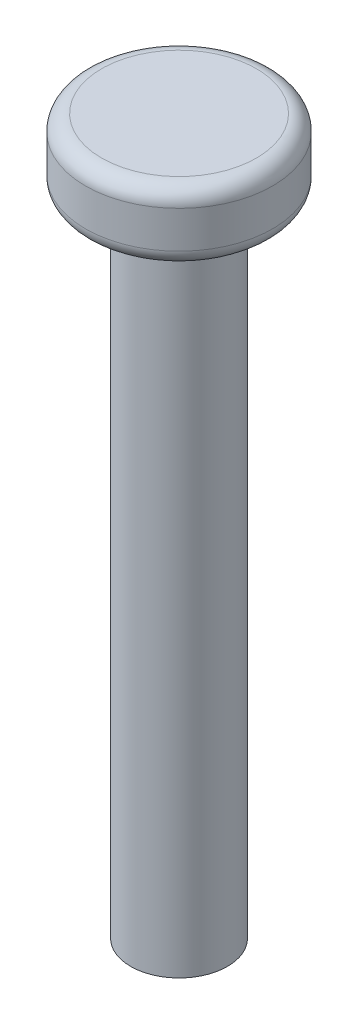
ISO-10303-21;
HEADER;
FILE_DESCRIPTION(('STEP AP214'),'2;1');
FILE_NAME('part.step','',(''),(''),'','','');
FILE_SCHEMA(('AUTOMOTIVE_DESIGN { 1 0 10303 214 1 1 1 1 }'));
ENDSEC;
DATA;
#1=APPLICATION_CONTEXT('core data for automotive mechanical design processes');
#2=APPLICATION_PROTOCOL_DEFINITION('international standard','automotive_design',2000,#1);
#3=PRODUCT_CONTEXT('',#1,'mechanical');
#4=PRODUCT('Part','Part','',(#3));
#5=PRODUCT_RELATED_PRODUCT_CATEGORY('part','',(#4));
#6=PRODUCT_DEFINITION_FORMATION('','',#4);
#7=PRODUCT_DEFINITION_CONTEXT('part definition',#1,'design');
#8=PRODUCT_DEFINITION('design','',#6,#7);
#9=PRODUCT_DEFINITION_SHAPE('','',#8);
#10=(LENGTH_UNIT() NAMED_UNIT(*) SI_UNIT(.MILLI.,.METRE.));
#11=(NAMED_UNIT(*) PLANE_ANGLE_UNIT() SI_UNIT($,.RADIAN.));
#12=(NAMED_UNIT(*) SI_UNIT($,.STERADIAN.) SOLID_ANGLE_UNIT());
#13=UNCERTAINTY_MEASURE_WITH_UNIT(LENGTH_MEASURE(1.E-05),#10,'distance_accuracy_value','');
#14=(GEOMETRIC_REPRESENTATION_CONTEXT(3) GLOBAL_UNCERTAINTY_ASSIGNED_CONTEXT((#13)) GLOBAL_UNIT_ASSIGNED_CONTEXT((#10,
#11,#12)) REPRESENTATION_CONTEXT('',''));
#15=CARTESIAN_POINT('',(0.,0.,0.));
#16=DIRECTION('',(0.,0.,1.));
#17=DIRECTION('',(1.,0.,0.));
#18=AXIS2_PLACEMENT_3D('',#15,#16,#17);
#19=CARTESIAN_POINT('',(0.,40.,0.));
#20=DIRECTION('',(0.,-1.,0.));
#21=DIRECTION('',(0.,0.,-1.));
#22=AXIS2_PLACEMENT_3D('',#19,#20,#21);
#23=CYLINDRICAL_SURFACE('',#22,3.);
#24=CARTESIAN_POINT('',(0.,40.,0.));
#25=DIRECTION('',(0.,1.,0.));
#26=DIRECTION('',(0.,0.,1.));
#27=AXIS2_PLACEMENT_3D('',#24,#25,#26);
#28=CIRCLE('',#27,3.);
#29=CARTESIAN_POINT('',(0.,40.,3.));
#30=VERTEX_POINT('',#29);
#31=EDGE_CURVE('E53',#30,#30,#28,.T.);
#32=ORIENTED_EDGE('',*,*,#31,.F.);
#33=EDGE_LOOP('',(#32));
#34=FACE_BOUND('',#33,.T.);
#35=CARTESIAN_POINT('',(0.,0.,0.));
#36=DIRECTION('',(0.,1.,0.));
#37=DIRECTION('',(0.,0.,1.));
#38=AXIS2_PLACEMENT_3D('',#35,#36,#37);
#39=CIRCLE('',#38,3.);
#40=CARTESIAN_POINT('',(0.,0.,3.));
#41=VERTEX_POINT('',#40);
#42=EDGE_CURVE('E54',#41,#41,#39,.T.);
#43=ORIENTED_EDGE('',*,*,#42,.T.);
#44=EDGE_LOOP('',(#43));
#45=FACE_BOUND('',#44,.T.);
#46=ADVANCED_FACE('F33',(#34,#45),#23,.T.);
#47=CARTESIAN_POINT('',(0.,0.,0.));
#48=DIRECTION('',(0.,1.,0.));
#49=DIRECTION('',(0.,0.,1.));
#50=AXIS2_PLACEMENT_3D('',#47,#48,#49);
#51=PLANE('',#50);
#52=ORIENTED_EDGE('',*,*,#42,.F.);
#53=EDGE_LOOP('',(#52));
#54=FACE_BOUND('',#53,.T.);
#55=ADVANCED_FACE('F64',(#54),#51,.F.);
#56=CARTESIAN_POINT('',(0.,44.3,0.));
#57=DIRECTION('',(0.,-1.,0.));
#58=DIRECTION('',(0.,0.,-1.));
#59=AXIS2_PLACEMENT_3D('',#56,#57,#58);
#60=CYLINDRICAL_SURFACE('',#59,5.8);
#61=CARTESIAN_POINT('',(0.,41.,0.));
#62=DIRECTION('',(0.,1.,0.));
#63=DIRECTION('',(0.,0.,1.));
#64=AXIS2_PLACEMENT_3D('',#61,#62,#63);
#65=CIRCLE('',#64,5.8);
#66=CARTESIAN_POINT('',(0.,41.,5.8));
#67=VERTEX_POINT('',#66);
#68=EDGE_CURVE('E44',#67,#67,#65,.T.);
#69=ORIENTED_EDGE('',*,*,#68,.T.);
#70=EDGE_LOOP('',(#69));
#71=FACE_BOUND('',#70,.T.);
#72=CARTESIAN_POINT('',(0.,43.3,0.));
#73=DIRECTION('',(0.,1.,0.));
#74=DIRECTION('',(0.,0.,1.));
#75=AXIS2_PLACEMENT_3D('',#72,#73,#74);
#76=CIRCLE('',#75,5.8);
#77=CARTESIAN_POINT('',(0.,43.3,5.8));
#78=VERTEX_POINT('',#77);
#79=EDGE_CURVE('E48',#78,#78,#76,.F.);
#80=ORIENTED_EDGE('',*,*,#79,.T.);
#81=EDGE_LOOP('',(#80));
#82=FACE_BOUND('',#81,.T.);
#83=ADVANCED_FACE('F69',(#71,#82),#60,.T.);
#84=CARTESIAN_POINT('',(0.,44.3,0.));
#85=DIRECTION('',(0.,1.,0.));
#86=DIRECTION('',(0.,0.,1.));
#87=AXIS2_PLACEMENT_3D('',#84,#85,#86);
#88=PLANE('',#87);
#89=CARTESIAN_POINT('',(0.,44.3,0.));
#90=DIRECTION('',(0.,1.,0.));
#91=DIRECTION('',(0.,0.,1.));
#92=AXIS2_PLACEMENT_3D('',#89,#90,#91);
#93=CIRCLE('',#92,4.8);
#94=CARTESIAN_POINT('',(0.,44.3,4.8));
#95=VERTEX_POINT('',#94);
#96=EDGE_CURVE('E10',#95,#95,#93,.T.);
#97=ORIENTED_EDGE('',*,*,#96,.T.);
#98=EDGE_LOOP('',(#97));
#99=FACE_BOUND('',#98,.T.);
#100=ADVANCED_FACE('F74',(#99),#88,.T.);
#101=CARTESIAN_POINT('',(0.,40.,0.));
#102=DIRECTION('',(0.,1.,0.));
#103=DIRECTION('',(0.,0.,1.));
#104=AXIS2_PLACEMENT_3D('',#101,#102,#103);
#105=PLANE('',#104);
#106=CARTESIAN_POINT('',(0.,40.,0.));
#107=DIRECTION('',(0.,1.,0.));
#108=DIRECTION('',(0.,0.,1.));
#109=AXIS2_PLACEMENT_3D('',#106,#107,#108);
#110=CIRCLE('',#109,4.8);
#111=CARTESIAN_POINT('',(0.,40.,4.8));
#112=VERTEX_POINT('',#111);
#113=EDGE_CURVE('E40',#112,#112,#110,.F.);
#114=ORIENTED_EDGE('',*,*,#113,.T.);
#115=EDGE_LOOP('',(#114));
#116=FACE_BOUND('',#115,.T.);
#117=ORIENTED_EDGE('',*,*,#31,.T.);
#118=EDGE_LOOP('',(#117));
#119=FACE_BOUND('',#118,.T.);
#120=ADVANCED_FACE('F60',(#116,#119),#105,.F.);
#121=CARTESIAN_POINT('',(0.,41.,0.));
#122=DIRECTION('',(0.,1.,0.));
#123=DIRECTION('',(0.,0.,1.));
#124=AXIS2_PLACEMENT_3D('',#121,#122,#123);
#125=TOROIDAL_SURFACE('',#124,4.8,1.);
#126=ORIENTED_EDGE('',*,*,#113,.F.);
#127=EDGE_LOOP('',(#126));
#128=FACE_BOUND('',#127,.T.);
#129=ORIENTED_EDGE('',*,*,#68,.F.);
#130=EDGE_LOOP('',(#129));
#131=FACE_BOUND('',#130,.T.);
#132=ADVANCED_FACE('F78',(#128,#131),#125,.T.);
#133=CARTESIAN_POINT('',(0.,43.3,0.));
#134=DIRECTION('',(0.,1.,0.));
#135=DIRECTION('',(0.,0.,1.));
#136=AXIS2_PLACEMENT_3D('',#133,#134,#135);
#137=TOROIDAL_SURFACE('',#136,4.8,1.);
#138=ORIENTED_EDGE('',*,*,#79,.F.);
#139=EDGE_LOOP('',(#138));
#140=FACE_BOUND('',#139,.T.);
#141=ORIENTED_EDGE('',*,*,#96,.F.);
#142=EDGE_LOOP('',(#141));
#143=FACE_BOUND('',#142,.T.);
#144=ADVANCED_FACE('F35',(#140,#143),#137,.T.);
#145=CLOSED_SHELL('',(#46,#55,#83,#100,#120,#132,#144));
#146=MANIFOLD_SOLID_BREP('B2',#145);
#147=ADVANCED_BREP_SHAPE_REPRESENTATION('',(#18,#146),#14);
#148=SHAPE_DEFINITION_REPRESENTATION(#9,#147);
ENDSEC;
END-ISO-10303-21;
